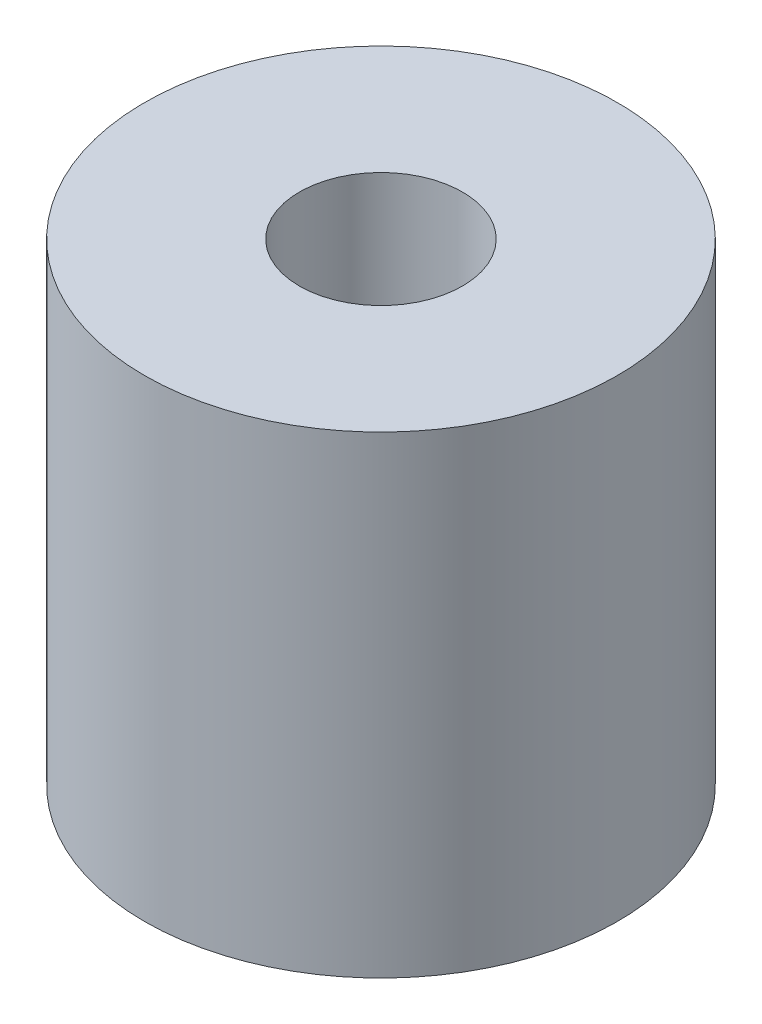
ISO-10303-21;
HEADER;
FILE_DESCRIPTION(('STEP AP214'),'2;1');
FILE_NAME('part.step','',(''),(''),'','','');
FILE_SCHEMA(('AUTOMOTIVE_DESIGN { 1 0 10303 214 1 1 1 1 }'));
ENDSEC;
DATA;
#1=APPLICATION_CONTEXT('core data for automotive mechanical design processes');
#2=APPLICATION_PROTOCOL_DEFINITION('international standard','automotive_design',2000,#1);
#3=PRODUCT_CONTEXT('',#1,'mechanical');
#4=PRODUCT('Part','Part','',(#3));
#5=PRODUCT_RELATED_PRODUCT_CATEGORY('part','',(#4));
#6=PRODUCT_DEFINITION_FORMATION('','',#4);
#7=PRODUCT_DEFINITION_CONTEXT('part definition',#1,'design');
#8=PRODUCT_DEFINITION('design','',#6,#7);
#9=PRODUCT_DEFINITION_SHAPE('','',#8);
#10=(LENGTH_UNIT() NAMED_UNIT(*) SI_UNIT(.MILLI.,.METRE.));
#11=(NAMED_UNIT(*) PLANE_ANGLE_UNIT() SI_UNIT($,.RADIAN.));
#12=(NAMED_UNIT(*) SI_UNIT($,.STERADIAN.) SOLID_ANGLE_UNIT());
#13=UNCERTAINTY_MEASURE_WITH_UNIT(LENGTH_MEASURE(1.E-05),#10,'distance_accuracy_value','');
#14=(GEOMETRIC_REPRESENTATION_CONTEXT(3) GLOBAL_UNCERTAINTY_ASSIGNED_CONTEXT((#13)) GLOBAL_UNIT_ASSIGNED_CONTEXT((#10,
#11,#12)) REPRESENTATION_CONTEXT('',''));
#15=CARTESIAN_POINT('',(0.,0.,0.));
#16=DIRECTION('',(0.,0.,1.));
#17=DIRECTION('',(1.,0.,0.));
#18=AXIS2_PLACEMENT_3D('',#15,#16,#17);
#19=CARTESIAN_POINT('',(0.,58.,0.));
#20=DIRECTION('',(0.,1.,0.));
#21=DIRECTION('',(0.,0.,1.));
#22=AXIS2_PLACEMENT_3D('',#19,#20,#21);
#23=PLANE('',#22);
#24=CARTESIAN_POINT('',(0.,58.,0.));
#25=DIRECTION('',(0.,1.,0.));
#26=DIRECTION('',(0.,0.,1.));
#27=AXIS2_PLACEMENT_3D('',#24,#25,#26);
#28=CIRCLE('',#27,29.);
#29=CARTESIAN_POINT('',(0.,58.,29.));
#30=VERTEX_POINT('',#29);
#31=EDGE_CURVE('E10',#30,#30,#28,.T.);
#32=ORIENTED_EDGE('',*,*,#31,.T.);
#33=EDGE_LOOP('',(#32));
#34=FACE_BOUND('',#33,.T.);
#35=CARTESIAN_POINT('',(0.,58.,0.));
#36=DIRECTION('',(0.,1.,0.));
#37=DIRECTION('',(0.,0.,1.));
#38=AXIS2_PLACEMENT_3D('',#35,#36,#37);
#39=CIRCLE('',#38,10.);
#40=CARTESIAN_POINT('',(0.,58.,10.));
#41=VERTEX_POINT('',#40);
#42=EDGE_CURVE('E42',#41,#41,#39,.T.);
#43=ORIENTED_EDGE('',*,*,#42,.F.);
#44=EDGE_LOOP('',(#43));
#45=FACE_BOUND('',#44,.T.);
#46=ADVANCED_FACE('F31',(#34,#45),#23,.T.);
#47=CARTESIAN_POINT('',(0.,0.,0.));
#48=DIRECTION('',(0.,1.,0.));
#49=DIRECTION('',(0.,0.,1.));
#50=AXIS2_PLACEMENT_3D('',#47,#48,#49);
#51=PLANE('',#50);
#52=CARTESIAN_POINT('',(0.,0.,0.));
#53=DIRECTION('',(0.,1.,0.));
#54=DIRECTION('',(0.,0.,1.));
#55=AXIS2_PLACEMENT_3D('',#52,#53,#54);
#56=CIRCLE('',#55,29.);
#57=CARTESIAN_POINT('',(0.,0.,29.));
#58=VERTEX_POINT('',#57);
#59=EDGE_CURVE('E35',#58,#58,#56,.T.);
#60=ORIENTED_EDGE('',*,*,#59,.F.);
#61=EDGE_LOOP('',(#60));
#62=FACE_BOUND('',#61,.T.);
#63=CARTESIAN_POINT('',(0.,0.,0.));
#64=DIRECTION('',(0.,1.,0.));
#65=DIRECTION('',(0.,0.,1.));
#66=AXIS2_PLACEMENT_3D('',#63,#64,#65);
#67=CIRCLE('',#66,10.);
#68=CARTESIAN_POINT('',(0.,0.,10.));
#69=VERTEX_POINT('',#68);
#70=EDGE_CURVE('E44',#69,#69,#67,.T.);
#71=ORIENTED_EDGE('',*,*,#70,.T.);
#72=EDGE_LOOP('',(#71));
#73=FACE_BOUND('',#72,.T.);
#74=ADVANCED_FACE('F54',(#62,#73),#51,.F.);
#75=CARTESIAN_POINT('',(0.,58.,0.));
#76=DIRECTION('',(0.,-1.,0.));
#77=DIRECTION('',(0.,0.,-1.));
#78=AXIS2_PLACEMENT_3D('',#75,#76,#77);
#79=CYLINDRICAL_SURFACE('',#78,29.);
#80=ORIENTED_EDGE('',*,*,#31,.F.);
#81=EDGE_LOOP('',(#80));
#82=FACE_BOUND('',#81,.T.);
#83=ORIENTED_EDGE('',*,*,#59,.T.);
#84=EDGE_LOOP('',(#83));
#85=FACE_BOUND('',#84,.T.);
#86=ADVANCED_FACE('F33',(#82,#85),#79,.T.);
#87=CARTESIAN_POINT('',(0.,58.,0.));
#88=DIRECTION('',(0.,-1.,0.));
#89=DIRECTION('',(0.,0.,-1.));
#90=AXIS2_PLACEMENT_3D('',#87,#88,#89);
#91=CYLINDRICAL_SURFACE('',#90,10.);
#92=ORIENTED_EDGE('',*,*,#42,.T.);
#93=EDGE_LOOP('',(#92));
#94=FACE_BOUND('',#93,.T.);
#95=ORIENTED_EDGE('',*,*,#70,.F.);
#96=EDGE_LOOP('',(#95));
#97=FACE_BOUND('',#96,.T.);
#98=ADVANCED_FACE('F50',(#94,#97),#91,.F.);
#99=CLOSED_SHELL('',(#46,#74,#86,#98));
#100=MANIFOLD_SOLID_BREP('B2',#99);
#101=ADVANCED_BREP_SHAPE_REPRESENTATION('',(#18,#100),#14);
#102=SHAPE_DEFINITION_REPRESENTATION(#9,#101);
ENDSEC;
END-ISO-10303-21;
